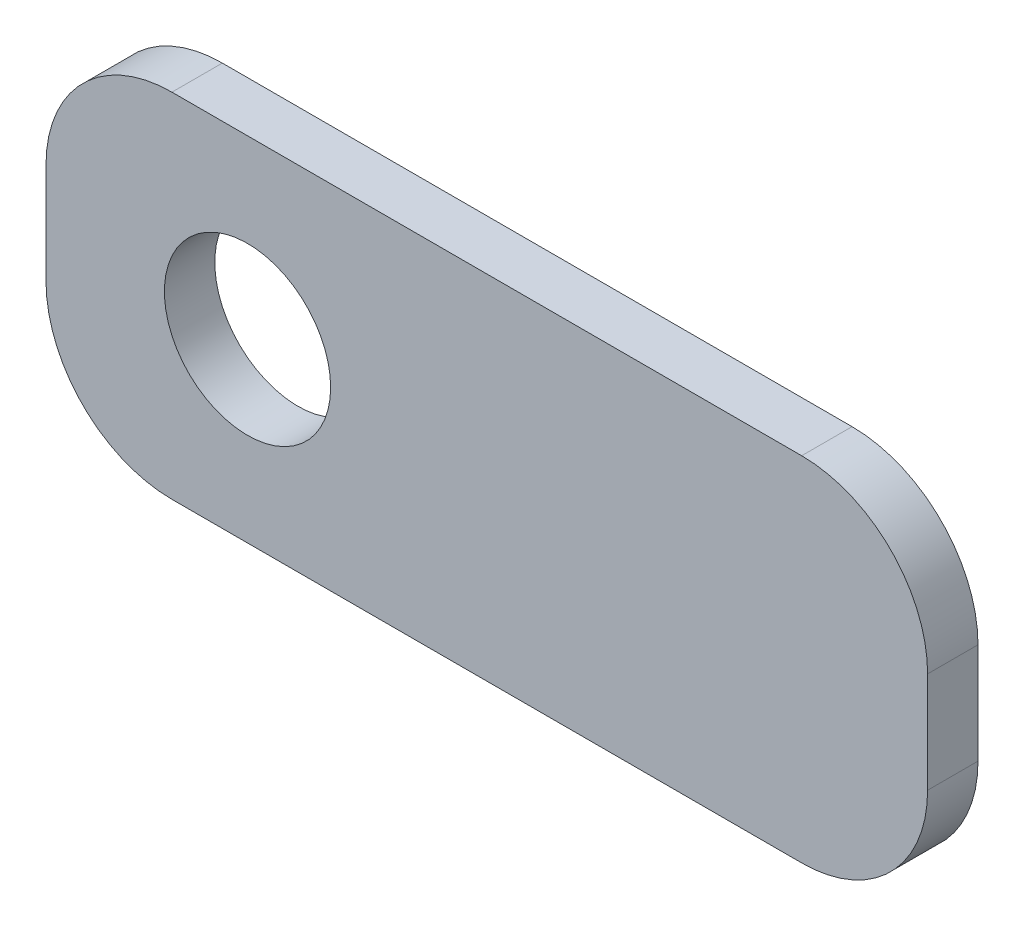
ISO-10303-21;
HEADER;
FILE_DESCRIPTION(('STEP AP214'),'2;1');
FILE_NAME('part.step','',(''),(''),'','','');
FILE_SCHEMA(('AUTOMOTIVE_DESIGN { 1 0 10303 214 1 1 1 1 }'));
ENDSEC;
DATA;
#1=APPLICATION_CONTEXT('core data for automotive mechanical design processes');
#2=APPLICATION_PROTOCOL_DEFINITION('international standard','automotive_design',2000,#1);
#3=PRODUCT_CONTEXT('',#1,'mechanical');
#4=PRODUCT('Part','Part','',(#3));
#5=PRODUCT_RELATED_PRODUCT_CATEGORY('part','',(#4));
#6=PRODUCT_DEFINITION_FORMATION('','',#4);
#7=PRODUCT_DEFINITION_CONTEXT('part definition',#1,'design');
#8=PRODUCT_DEFINITION('design','',#6,#7);
#9=PRODUCT_DEFINITION_SHAPE('','',#8);
#10=(LENGTH_UNIT() NAMED_UNIT(*) SI_UNIT(.MILLI.,.METRE.));
#11=(NAMED_UNIT(*) PLANE_ANGLE_UNIT() SI_UNIT($,.RADIAN.));
#12=(NAMED_UNIT(*) SI_UNIT($,.STERADIAN.) SOLID_ANGLE_UNIT());
#13=UNCERTAINTY_MEASURE_WITH_UNIT(LENGTH_MEASURE(1.E-05),#10,'distance_accuracy_value','');
#14=(GEOMETRIC_REPRESENTATION_CONTEXT(3) GLOBAL_UNCERTAINTY_ASSIGNED_CONTEXT((#13)) GLOBAL_UNIT_ASSIGNED_CONTEXT((#10,
#11,#12)) REPRESENTATION_CONTEXT('',''));
#15=CARTESIAN_POINT('',(0.,0.,0.));
#16=DIRECTION('',(0.,0.,1.));
#17=DIRECTION('',(1.,0.,0.));
#18=AXIS2_PLACEMENT_3D('',#15,#16,#17);
#19=CARTESIAN_POINT('',(17.5000000000001,-7.00000000000117,0.));
#20=DIRECTION('',(0.,-1.,0.));
#21=DIRECTION('',(1.,0.,0.));
#22=AXIS2_PLACEMENT_3D('',#19,#20,#21);
#23=PLANE('',#22);
#24=DIRECTION('',(0.,0.,0.999999999999987));
#25=VECTOR('',#24,1.);
#26=CARTESIAN_POINT('',(-12.5,-6.9999999999984,0.));
#27=LINE('',#26,#25);
#28=CARTESIAN_POINT('',(-12.5,-6.99999999999822,-1.99999999999979));
#29=VERTEX_POINT('',#28);
#30=CARTESIAN_POINT('',(-12.5,-6.9999999999984,0.));
#31=VERTEX_POINT('',#30);
#32=EDGE_CURVE('E11',#29,#31,#27,.T.);
#33=ORIENTED_EDGE('',*,*,#32,.F.);
#34=DIRECTION('',(1.,0.,0.));
#35=VECTOR('',#34,1.);
#36=CARTESIAN_POINT('',(0.,-6.99999999999842,-1.99999999999994));
#37=LINE('',#36,#35);
#38=CARTESIAN_POINT('',(12.5,-7.00000000000122,-2.00000000000008));
#39=VERTEX_POINT('',#38);
#40=EDGE_CURVE('E110',#29,#39,#37,.T.);
#41=ORIENTED_EDGE('',*,*,#40,.T.);
#42=DIRECTION('',(0.,0.,0.999999999999987));
#43=VECTOR('',#42,1.);
#44=CARTESIAN_POINT('',(12.5,-7.00000000000139,-1.11022302462516E-13));
#45=LINE('',#44,#43);
#46=CARTESIAN_POINT('',(12.5,-7.00000000000139,-1.11022302462516E-13));
#47=VERTEX_POINT('',#46);
#48=EDGE_CURVE('E53',#39,#47,#45,.T.);
#49=ORIENTED_EDGE('',*,*,#48,.T.);
#50=DIRECTION('',(1.,0.,0.));
#51=VECTOR('',#50,1.);
#52=CARTESIAN_POINT('',(17.5000000000001,-7.00000000000117,0.));
#53=LINE('',#52,#51);
#54=EDGE_CURVE('E161',#31,#47,#53,.T.);
#55=ORIENTED_EDGE('',*,*,#54,.F.);
#56=EDGE_LOOP('',(#33,#41,#49,#55));
#57=FACE_BOUND('',#56,.T.);
#58=ADVANCED_FACE('F43',(#57),#23,.T.);
#59=CARTESIAN_POINT('',(12.5,-2.000000000005,0.));
#60=DIRECTION('',(0.,0.,0.999999999999987));
#61=DIRECTION('',(1.,0.,0.));
#62=AXIS2_PLACEMENT_3D('',#59,#60,#61);
#63=CYLINDRICAL_SURFACE('',#62,5.);
#64=ORIENTED_EDGE('',*,*,#48,.F.);
#65=CARTESIAN_POINT('',(12.5,-2.00000000000501,-1.99999999999992));
#66=DIRECTION('',(0.,0.,0.999999999999987));
#67=DIRECTION('',(1.,0.,0.));
#68=AXIS2_PLACEMENT_3D('',#65,#66,#67);
#69=CIRCLE('',#68,5.);
#70=CARTESIAN_POINT('',(17.5000000000001,-2.00000000000473,-2.00000000000017));
#71=VERTEX_POINT('',#70);
#72=EDGE_CURVE('E139',#39,#71,#69,.T.);
#73=ORIENTED_EDGE('',*,*,#72,.T.);
#74=DIRECTION('',(0.,0.,0.999999999999987));
#75=VECTOR('',#74,1.);
#76=CARTESIAN_POINT('',(17.5000000000001,-2.00000000000478,0.));
#77=LINE('',#76,#75);
#78=CARTESIAN_POINT('',(17.5000000000001,-2.00000000000478,0.));
#79=VERTEX_POINT('',#78);
#80=EDGE_CURVE('E154',#71,#79,#77,.T.);
#81=ORIENTED_EDGE('',*,*,#80,.T.);
#82=CARTESIAN_POINT('',(12.5,-2.000000000005,0.));
#83=DIRECTION('',(0.,0.,0.999999999999987));
#84=DIRECTION('',(1.,0.,0.));
#85=AXIS2_PLACEMENT_3D('',#82,#83,#84);
#86=CIRCLE('',#85,5.);
#87=EDGE_CURVE('E170',#47,#79,#86,.T.);
#88=ORIENTED_EDGE('',*,*,#87,.F.);
#89=EDGE_LOOP('',(#64,#73,#81,#88));
#90=FACE_BOUND('',#89,.T.);
#91=ADVANCED_FACE('F174',(#90),#63,.T.);
#92=CARTESIAN_POINT('',(17.5000000000001,-7.00000000000117,0.));
#93=DIRECTION('',(1.,0.,0.));
#94=DIRECTION('',(0.,1.00000000000002,0.));
#95=AXIS2_PLACEMENT_3D('',#92,#93,#94);
#96=PLANE('',#95);
#97=ORIENTED_EDGE('',*,*,#80,.F.);
#98=DIRECTION('',(0.,0.999999999999987,0.));
#99=VECTOR('',#98,1.);
#100=CARTESIAN_POINT('',(17.5000000000002,-2.80301651499845E-13,-2.00000000000018));
#101=LINE('',#100,#99);
#102=CARTESIAN_POINT('',(17.5,1.99999999999517,-2.00000000000019));
#103=VERTEX_POINT('',#102);
#104=EDGE_CURVE('E135',#71,#103,#101,.T.);
#105=ORIENTED_EDGE('',*,*,#104,.T.);
#106=DIRECTION('',(0.,0.,0.999999999999987));
#107=VECTOR('',#106,1.);
#108=CARTESIAN_POINT('',(17.5,1.99999999999523,1.11022302462516E-13));
#109=LINE('',#108,#107);
#110=CARTESIAN_POINT('',(17.5,1.99999999999523,1.11022302462516E-13));
#111=VERTEX_POINT('',#110);
#112=EDGE_CURVE('E151',#103,#111,#109,.T.);
#113=ORIENTED_EDGE('',*,*,#112,.T.);
#114=DIRECTION('',(0.,1.00000000000002,0.));
#115=VECTOR('',#114,1.);
#116=CARTESIAN_POINT('',(17.5000000000001,-7.00000000000117,0.));
#117=LINE('',#116,#115);
#118=EDGE_CURVE('E176',#79,#111,#117,.T.);
#119=ORIENTED_EDGE('',*,*,#118,.F.);
#120=EDGE_LOOP('',(#97,#105,#113,#119));
#121=FACE_BOUND('',#120,.T.);
#122=ADVANCED_FACE('F206',(#121),#96,.T.);
#123=CARTESIAN_POINT('',(12.5,1.99999999999501,0.));
#124=DIRECTION('',(0.,0.,0.999999999999987));
#125=DIRECTION('',(1.,0.,0.));
#126=AXIS2_PLACEMENT_3D('',#123,#124,#125);
#127=CYLINDRICAL_SURFACE('',#126,5.);
#128=ORIENTED_EDGE('',*,*,#112,.F.);
#129=CARTESIAN_POINT('',(12.5,1.999999999995,-1.99999999999987));
#130=DIRECTION('',(0.,0.,0.999999999999987));
#131=DIRECTION('',(1.,0.,0.));
#132=AXIS2_PLACEMENT_3D('',#129,#130,#131);
#133=CIRCLE('',#132,5.);
#134=CARTESIAN_POINT('',(12.4999999999996,6.99999999999482,-2.00000000000015));
#135=VERTEX_POINT('',#134);
#136=EDGE_CURVE('E131',#103,#135,#133,.T.);
#137=ORIENTED_EDGE('',*,*,#136,.T.);
#138=DIRECTION('',(0.,0.,0.999999999999987));
#139=VECTOR('',#138,1.);
#140=CARTESIAN_POINT('',(12.4999999999996,6.99999999999501,1.36002320516582E-12));
#141=LINE('',#140,#139);
#142=CARTESIAN_POINT('',(12.4999999999996,6.99999999999501,1.36002320516582E-12));
#143=VERTEX_POINT('',#142);
#144=EDGE_CURVE('E148',#135,#143,#141,.T.);
#145=ORIENTED_EDGE('',*,*,#144,.T.);
#146=CARTESIAN_POINT('',(12.5,1.99999999999501,0.));
#147=DIRECTION('',(0.,0.,0.999999999999987));
#148=DIRECTION('',(1.,0.,0.));
#149=AXIS2_PLACEMENT_3D('',#146,#147,#148);
#150=CIRCLE('',#149,5.);
#151=EDGE_CURVE('E180',#111,#143,#150,.T.);
#152=ORIENTED_EDGE('',*,*,#151,.F.);
#153=EDGE_LOOP('',(#128,#137,#145,#152));
#154=FACE_BOUND('',#153,.T.);
#155=ADVANCED_FACE('F202',(#154),#127,.T.);
#156=CARTESIAN_POINT('',(17.5,6.99999999999523,1.36002320516582E-12));
#157=DIRECTION('',(0.,1.,0.));
#158=DIRECTION('',(-1.,0.,0.));
#159=AXIS2_PLACEMENT_3D('',#156,#157,#158);
#160=PLANE('',#159);
#161=ORIENTED_EDGE('',*,*,#144,.F.);
#162=DIRECTION('',(1.,0.,0.));
#163=VECTOR('',#162,1.);
#164=CARTESIAN_POINT('',(1.31370063642919E-13,6.99999999999501,-2.00000000000001));
#165=LINE('',#164,#163);
#166=CARTESIAN_POINT('',(-12.5000000000004,6.99999999999981,-1.99999999999986));
#167=VERTEX_POINT('',#166);
#168=EDGE_CURVE('E127',#135,#167,#165,.F.);
#169=ORIENTED_EDGE('',*,*,#168,.T.);
#170=DIRECTION('',(0.,0.,0.999999999999987));
#171=VECTOR('',#170,1.);
#172=CARTESIAN_POINT('',(-12.5000000000005,7.00000000000001,1.30451205393456E-12));
#173=LINE('',#172,#171);
#174=CARTESIAN_POINT('',(-12.5000000000005,7.00000000000001,1.30451205393456E-12));
#175=VERTEX_POINT('',#174);
#176=EDGE_CURVE('E146',#167,#175,#173,.T.);
#177=ORIENTED_EDGE('',*,*,#176,.T.);
#178=DIRECTION('',(-1.,0.,0.));
#179=VECTOR('',#178,1.);
#180=CARTESIAN_POINT('',(17.5,6.99999999999523,1.36002320516582E-12));
#181=LINE('',#180,#179);
#182=EDGE_CURVE('E187',#143,#175,#181,.T.);
#183=ORIENTED_EDGE('',*,*,#182,.F.);
#184=EDGE_LOOP('',(#161,#169,#177,#183));
#185=FACE_BOUND('',#184,.T.);
#186=ADVANCED_FACE('F198',(#185),#160,.T.);
#187=CARTESIAN_POINT('',(-12.5,2.,0.));
#188=DIRECTION('',(0.,0.,0.999999999999987));
#189=DIRECTION('',(1.,0.,0.));
#190=AXIS2_PLACEMENT_3D('',#187,#188,#189);
#191=CYLINDRICAL_SURFACE('',#190,5.);
#192=ORIENTED_EDGE('',*,*,#176,.F.);
#193=CARTESIAN_POINT('',(-12.5,1.99999999999999,-1.99999999999998));
#194=DIRECTION('',(0.,0.,0.999999999999987));
#195=DIRECTION('',(1.,0.,0.));
#196=AXIS2_PLACEMENT_3D('',#193,#194,#195);
#197=CIRCLE('',#196,5.);
#198=CARTESIAN_POINT('',(-17.5000000000007,1.99999999999994,-1.99999999999978));
#199=VERTEX_POINT('',#198);
#200=EDGE_CURVE('E123',#167,#199,#197,.T.);
#201=ORIENTED_EDGE('',*,*,#200,.T.);
#202=DIRECTION('',(0.,0.,0.999999999999987));
#203=VECTOR('',#202,1.);
#204=CARTESIAN_POINT('',(-17.5000000000008,2.,0.));
#205=LINE('',#204,#203);
#206=CARTESIAN_POINT('',(-17.5000000000008,2.,0.));
#207=VERTEX_POINT('',#206);
#208=EDGE_CURVE('E61',#199,#207,#205,.T.);
#209=ORIENTED_EDGE('',*,*,#208,.T.);
#210=CARTESIAN_POINT('',(-12.5,2.,0.));
#211=DIRECTION('',(0.,0.,0.999999999999987));
#212=DIRECTION('',(1.,0.,0.));
#213=AXIS2_PLACEMENT_3D('',#210,#211,#212);
#214=CIRCLE('',#213,5.);
#215=EDGE_CURVE('E103',#175,#207,#214,.T.);
#216=ORIENTED_EDGE('',*,*,#215,.F.);
#217=EDGE_LOOP('',(#192,#201,#209,#216));
#218=FACE_BOUND('',#217,.T.);
#219=ADVANCED_FACE('F195',(#218),#191,.T.);
#220=CARTESIAN_POINT('',(-17.5000000000006,-6.9999999999984,0.));
#221=DIRECTION('',(-1.,0.,0.));
#222=DIRECTION('',(0.,-1.00000000000002,0.));
#223=AXIS2_PLACEMENT_3D('',#220,#221,#222);
#224=PLANE('',#223);
#225=ORIENTED_EDGE('',*,*,#208,.F.);
#226=DIRECTION('',(0.,0.999999999999987,0.));
#227=VECTOR('',#226,1.);
#228=CARTESIAN_POINT('',(-17.5000000000008,2.60793295126862E-13,-1.99999999999977));
#229=LINE('',#228,#227);
#230=CARTESIAN_POINT('',(-17.5000000000004,-1.99999999999996,-1.99999999999976));
#231=VERTEX_POINT('',#230);
#232=EDGE_CURVE('E108',#199,#231,#229,.F.);
#233=ORIENTED_EDGE('',*,*,#232,.T.);
#234=DIRECTION('',(0.,0.,0.999999999999987));
#235=VECTOR('',#234,1.);
#236=CARTESIAN_POINT('',(-17.5000000000004,-2.,0.));
#237=LINE('',#236,#235);
#238=CARTESIAN_POINT('',(-17.5000000000004,-2.,0.));
#239=VERTEX_POINT('',#238);
#240=EDGE_CURVE('E47',#231,#239,#237,.T.);
#241=ORIENTED_EDGE('',*,*,#240,.T.);
#242=DIRECTION('',(0.,-1.00000000000002,0.));
#243=VECTOR('',#242,1.);
#244=CARTESIAN_POINT('',(-17.5000000000006,-6.9999999999984,0.));
#245=LINE('',#244,#243);
#246=EDGE_CURVE('E193',#207,#239,#245,.T.);
#247=ORIENTED_EDGE('',*,*,#246,.F.);
#248=EDGE_LOOP('',(#225,#233,#241,#247));
#249=FACE_BOUND('',#248,.T.);
#250=ADVANCED_FACE('F113',(#249),#224,.T.);
#251=CARTESIAN_POINT('',(-9.50000000000001,0.,0.));
#252=DIRECTION('',(0.,0.,0.999999999999987));
#253=DIRECTION('',(1.,0.,0.));
#254=AXIS2_PLACEMENT_3D('',#251,#252,#253);
#255=CYLINDRICAL_SURFACE('',#254,3.3);
#256=CARTESIAN_POINT('',(-9.50000000000001,0.,0.));
#257=DIRECTION('',(0.,0.,0.999999999999987));
#258=DIRECTION('',(1.,0.,0.));
#259=AXIS2_PLACEMENT_3D('',#256,#257,#258);
#260=CIRCLE('',#259,3.3);
#261=CARTESIAN_POINT('',(-6.20000000000001,0.,0.));
#262=VERTEX_POINT('',#261);
#263=EDGE_CURVE('E126',#262,#262,#260,.T.);
#264=ORIENTED_EDGE('',*,*,#263,.T.);
#265=EDGE_LOOP('',(#264));
#266=FACE_BOUND('',#265,.T.);
#267=CARTESIAN_POINT('',(-9.49999999999999,0.,-1.99999999999998));
#268=DIRECTION('',(0.,0.,0.999999999999987));
#269=DIRECTION('',(1.,0.,0.));
#270=AXIS2_PLACEMENT_3D('',#267,#268,#269);
#271=CIRCLE('',#270,3.3);
#272=CARTESIAN_POINT('',(-6.19999999999999,0.,-1.99999999999994));
#273=VERTEX_POINT('',#272);
#274=EDGE_CURVE('E115',#273,#273,#271,.T.);
#275=ORIENTED_EDGE('',*,*,#274,.F.);
#276=EDGE_LOOP('',(#275));
#277=FACE_BOUND('',#276,.T.);
#278=ADVANCED_FACE('F271',(#266,#277),#255,.F.);
#279=CARTESIAN_POINT('',(-12.4999999999999,-2.,0.));
#280=DIRECTION('',(0.,0.,0.999999999999987));
#281=DIRECTION('',(1.,0.,0.));
#282=AXIS2_PLACEMENT_3D('',#279,#280,#281);
#283=CYLINDRICAL_SURFACE('',#282,5.);
#284=CARTESIAN_POINT('',(-12.4999999999999,-2.00000000000001,-1.99999999999998));
#285=DIRECTION('',(0.,0.,0.999999999999987));
#286=DIRECTION('',(1.,0.,0.));
#287=AXIS2_PLACEMENT_3D('',#284,#285,#286);
#288=CIRCLE('',#287,5.);
#289=EDGE_CURVE('E97',#231,#29,#288,.T.);
#290=ORIENTED_EDGE('',*,*,#289,.T.);
#291=ORIENTED_EDGE('',*,*,#32,.T.);
#292=CARTESIAN_POINT('',(-12.4999999999999,-2.,0.));
#293=DIRECTION('',(0.,0.,0.999999999999987));
#294=DIRECTION('',(1.,0.,0.));
#295=AXIS2_PLACEMENT_3D('',#292,#293,#294);
#296=CIRCLE('',#295,5.);
#297=EDGE_CURVE('E99',#239,#31,#296,.T.);
#298=ORIENTED_EDGE('',*,*,#297,.F.);
#299=ORIENTED_EDGE('',*,*,#240,.F.);
#300=EDGE_LOOP('',(#290,#291,#298,#299));
#301=FACE_BOUND('',#300,.T.);
#302=ADVANCED_FACE('F45',(#301),#283,.T.);
#303=CARTESIAN_POINT('',(0.,0.,0.));
#304=DIRECTION('',(0.,0.,0.999999999999987));
#305=DIRECTION('',(1.,0.,0.));
#306=AXIS2_PLACEMENT_3D('',#303,#304,#305);
#307=PLANE('',#306);
#308=ORIENTED_EDGE('',*,*,#263,.F.);
#309=EDGE_LOOP('',(#308));
#310=FACE_BOUND('',#309,.T.);
#311=ORIENTED_EDGE('',*,*,#246,.T.);
#312=ORIENTED_EDGE('',*,*,#297,.T.);
#313=ORIENTED_EDGE('',*,*,#54,.T.);
#314=ORIENTED_EDGE('',*,*,#87,.T.);
#315=ORIENTED_EDGE('',*,*,#118,.T.);
#316=ORIENTED_EDGE('',*,*,#151,.T.);
#317=ORIENTED_EDGE('',*,*,#182,.T.);
#318=ORIENTED_EDGE('',*,*,#215,.T.);
#319=EDGE_LOOP('',(#311,#312,#313,#314,#315,#316,#317,#318));
#320=FACE_BOUND('',#319,.T.);
#321=ADVANCED_FACE('F168',(#310,#320),#307,.T.);
#322=CARTESIAN_POINT('',(0.,0.,-1.99999999999997));
#323=DIRECTION('',(0.,0.,0.999999999999987));
#324=DIRECTION('',(1.,0.,0.));
#325=AXIS2_PLACEMENT_3D('',#322,#323,#324);
#326=PLANE('',#325);
#327=ORIENTED_EDGE('',*,*,#274,.T.);
#328=EDGE_LOOP('',(#327));
#329=FACE_BOUND('',#328,.T.);
#330=ORIENTED_EDGE('',*,*,#232,.F.);
#331=ORIENTED_EDGE('',*,*,#200,.F.);
#332=ORIENTED_EDGE('',*,*,#168,.F.);
#333=ORIENTED_EDGE('',*,*,#136,.F.);
#334=ORIENTED_EDGE('',*,*,#104,.F.);
#335=ORIENTED_EDGE('',*,*,#72,.F.);
#336=ORIENTED_EDGE('',*,*,#40,.F.);
#337=ORIENTED_EDGE('',*,*,#289,.F.);
#338=EDGE_LOOP('',(#330,#331,#332,#333,#334,#335,#336,#337));
#339=FACE_BOUND('',#338,.T.);
#340=ADVANCED_FACE('F106',(#329,#339),#326,.F.);
#341=CLOSED_SHELL('',(#58,#91,#122,#155,#186,#219,#250,#278,#302,#321,#340));
#342=MANIFOLD_SOLID_BREP('B2',#341);
#343=ADVANCED_BREP_SHAPE_REPRESENTATION('',(#18,#342),#14);
#344=SHAPE_DEFINITION_REPRESENTATION(#9,#343);
ENDSEC;
END-ISO-10303-21;
